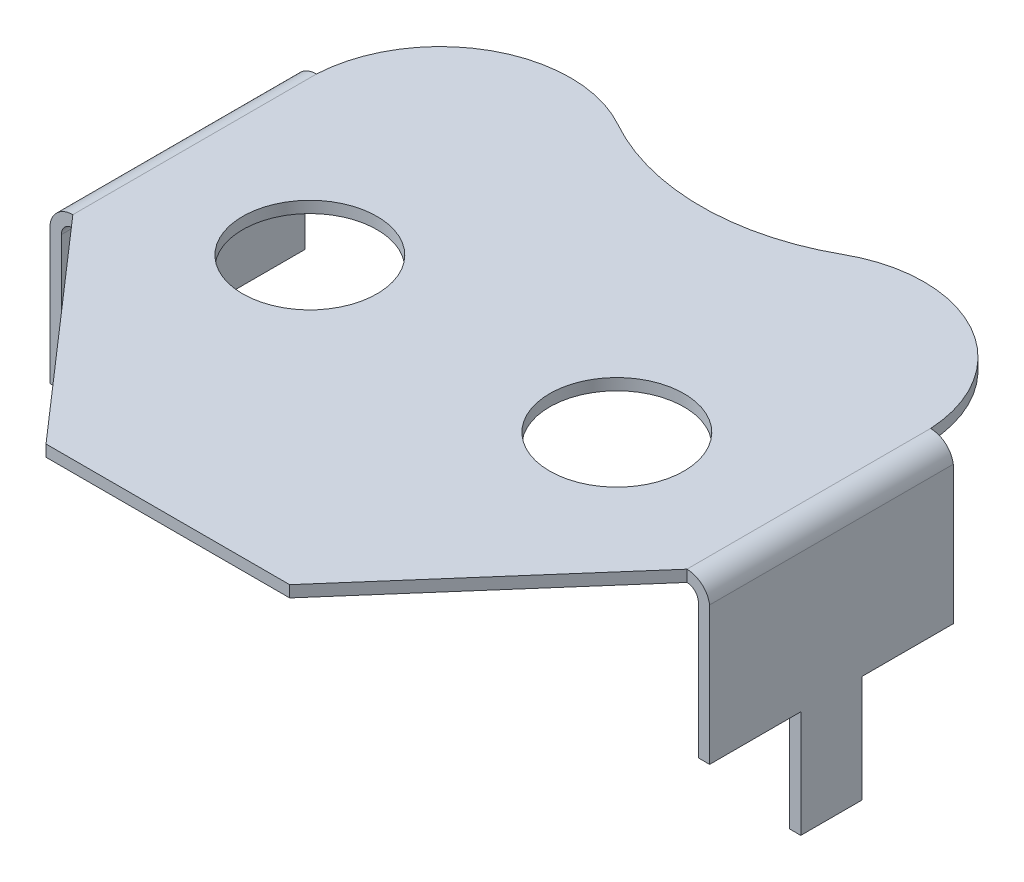
ISO-10303-21;
HEADER;
FILE_DESCRIPTION(('STEP AP214'),'2;1');
FILE_NAME('part.step','',(''),(''),'','','');
FILE_SCHEMA(('AUTOMOTIVE_DESIGN { 1 0 10303 214 1 1 1 1 }'));
ENDSEC;
DATA;
#1=APPLICATION_CONTEXT('core data for automotive mechanical design processes');
#2=APPLICATION_PROTOCOL_DEFINITION('international standard','automotive_design',2000,#1);
#3=PRODUCT_CONTEXT('',#1,'mechanical');
#4=PRODUCT('Part','Part','',(#3));
#5=PRODUCT_RELATED_PRODUCT_CATEGORY('part','',(#4));
#6=PRODUCT_DEFINITION_FORMATION('','',#4);
#7=PRODUCT_DEFINITION_CONTEXT('part definition',#1,'design');
#8=PRODUCT_DEFINITION('design','',#6,#7);
#9=PRODUCT_DEFINITION_SHAPE('','',#8);
#10=(LENGTH_UNIT() NAMED_UNIT(*) SI_UNIT(.MILLI.,.METRE.));
#11=(NAMED_UNIT(*) PLANE_ANGLE_UNIT() SI_UNIT($,.RADIAN.));
#12=(NAMED_UNIT(*) SI_UNIT($,.STERADIAN.) SOLID_ANGLE_UNIT());
#13=UNCERTAINTY_MEASURE_WITH_UNIT(LENGTH_MEASURE(1.E-05),#10,'distance_accuracy_value','');
#14=(GEOMETRIC_REPRESENTATION_CONTEXT(3) GLOBAL_UNCERTAINTY_ASSIGNED_CONTEXT((#13)) GLOBAL_UNIT_ASSIGNED_CONTEXT((#10,
#11,#12)) REPRESENTATION_CONTEXT('',''));
#15=CARTESIAN_POINT('',(0.,0.,0.));
#16=DIRECTION('',(0.,0.,1.));
#17=DIRECTION('',(1.,0.,0.));
#18=AXIS2_PLACEMENT_3D('',#15,#16,#17);
#19=CARTESIAN_POINT('',(-8.593211597999,-2.79,-3.175));
#20=DIRECTION('',(-1.,0.,0.));
#21=DIRECTION('',(0.,0.,1.));
#22=AXIS2_PLACEMENT_3D('',#19,#20,#21);
#23=PLANE('',#22);
#24=DIRECTION('',(0.,1.,0.));
#25=VECTOR('',#24,1.);
#26=CARTESIAN_POINT('',(-8.593211597999,3.6,3.175));
#27=LINE('',#26,#25);
#28=CARTESIAN_POINT('',(-8.593211597999,0.,3.175));
#29=VERTEX_POINT('',#28);
#30=CARTESIAN_POINT('',(-8.59321159799878,3.5999999999985,3.175));
#31=VERTEX_POINT('',#30);
#32=EDGE_CURVE('E231',#29,#31,#27,.T.);
#33=ORIENTED_EDGE('',*,*,#32,.T.);
#34=DIRECTION('',(0.,0.,-1.));
#35=VECTOR('',#34,1.);
#36=CARTESIAN_POINT('',(-8.59321159799857,3.59999999999993,10.));
#37=LINE('',#36,#35);
#38=CARTESIAN_POINT('',(-8.59321159799878,3.5999999999985,-3.175));
#39=VERTEX_POINT('',#38);
#40=EDGE_CURVE('E219',#39,#31,#37,.F.);
#41=ORIENTED_EDGE('',*,*,#40,.F.);
#42=DIRECTION('',(0.,-1.,0.));
#43=VECTOR('',#42,1.);
#44=CARTESIAN_POINT('',(-8.593211597999,0.,-3.175));
#45=LINE('',#44,#43);
#46=CARTESIAN_POINT('',(-8.593211597999,0.,-3.175));
#47=VERTEX_POINT('',#46);
#48=EDGE_CURVE('E185',#39,#47,#45,.T.);
#49=ORIENTED_EDGE('',*,*,#48,.T.);
#50=DIRECTION('',(0.,0.,1.));
#51=VECTOR('',#50,1.);
#52=CARTESIAN_POINT('',(-8.593211597999,0.,-0.8));
#53=LINE('',#52,#51);
#54=CARTESIAN_POINT('',(-8.593211597999,0.,-0.799999999999997));
#55=VERTEX_POINT('',#54);
#56=EDGE_CURVE('E184',#47,#55,#53,.T.);
#57=ORIENTED_EDGE('',*,*,#56,.T.);
#58=DIRECTION('',(0.,-1.,0.));
#59=VECTOR('',#58,1.);
#60=CARTESIAN_POINT('',(-8.593211597999,-2.79,-0.8));
#61=LINE('',#60,#59);
#62=CARTESIAN_POINT('',(-8.593211597999,-2.79,-0.8));
#63=VERTEX_POINT('',#62);
#64=EDGE_CURVE('E263',#55,#63,#61,.T.);
#65=ORIENTED_EDGE('',*,*,#64,.T.);
#66=DIRECTION('',(0.,0.,-1.));
#67=VECTOR('',#66,1.);
#68=CARTESIAN_POINT('',(-8.593211597999,-2.79,10.));
#69=LINE('',#68,#67);
#70=CARTESIAN_POINT('',(-8.593211597999,-2.79,0.800000000000003));
#71=VERTEX_POINT('',#70);
#72=EDGE_CURVE('E260',#71,#63,#69,.T.);
#73=ORIENTED_EDGE('',*,*,#72,.F.);
#74=DIRECTION('',(0.,1.,0.));
#75=VECTOR('',#74,1.);
#76=CARTESIAN_POINT('',(-8.593211597999,0.,0.8));
#77=LINE('',#76,#75);
#78=CARTESIAN_POINT('',(-8.593211597999,0.,0.8));
#79=VERTEX_POINT('',#78);
#80=EDGE_CURVE('E255',#71,#79,#77,.T.);
#81=ORIENTED_EDGE('',*,*,#80,.T.);
#82=DIRECTION('',(0.,0.,1.));
#83=VECTOR('',#82,1.);
#84=CARTESIAN_POINT('',(-8.593211597999,0.,3.175));
#85=LINE('',#84,#83);
#86=EDGE_CURVE('E249',#79,#29,#85,.T.);
#87=ORIENTED_EDGE('',*,*,#86,.T.);
#88=EDGE_LOOP('',(#33,#41,#49,#57,#65,#73,#81,#87));
#89=FACE_BOUND('',#88,.T.);
#90=ADVANCED_FACE('F17',(#89),#23,.T.);
#91=CARTESIAN_POINT('',(8.593211597999,-2.79,-3.175));
#92=DIRECTION('',(1.,0.,0.));
#93=DIRECTION('',(0.,0.,-1.));
#94=AXIS2_PLACEMENT_3D('',#91,#92,#93);
#95=PLANE('',#94);
#96=DIRECTION('',(0.,-1.,0.));
#97=VECTOR('',#96,1.);
#98=CARTESIAN_POINT('',(8.593211597999,0.,-3.175));
#99=LINE('',#98,#97);
#100=CARTESIAN_POINT('',(8.593211597999,0.,-3.175));
#101=VERTEX_POINT('',#100);
#102=CARTESIAN_POINT('',(8.59321159799878,3.5999999999985,-3.175));
#103=VERTEX_POINT('',#102);
#104=EDGE_CURVE('E315',#101,#103,#99,.F.);
#105=ORIENTED_EDGE('',*,*,#104,.T.);
#106=DIRECTION('',(0.,0.,-1.));
#107=VECTOR('',#106,1.);
#108=CARTESIAN_POINT('',(8.59321159799857,3.59999999999993,10.));
#109=LINE('',#108,#107);
#110=CARTESIAN_POINT('',(8.59321159799878,3.5999999999985,3.175));
#111=VERTEX_POINT('',#110);
#112=EDGE_CURVE('E216',#111,#103,#109,.T.);
#113=ORIENTED_EDGE('',*,*,#112,.F.);
#114=DIRECTION('',(0.,1.,0.));
#115=VECTOR('',#114,1.);
#116=CARTESIAN_POINT('',(8.593211597999,3.6,3.175));
#117=LINE('',#116,#115);
#118=CARTESIAN_POINT('',(8.593211597999,0.,3.175));
#119=VERTEX_POINT('',#118);
#120=EDGE_CURVE('E770',#111,#119,#117,.F.);
#121=ORIENTED_EDGE('',*,*,#120,.T.);
#122=DIRECTION('',(0.,0.,1.));
#123=VECTOR('',#122,1.);
#124=CARTESIAN_POINT('',(8.593211597999,0.,3.175));
#125=LINE('',#124,#123);
#126=CARTESIAN_POINT('',(8.593211597999,0.,0.8));
#127=VERTEX_POINT('',#126);
#128=EDGE_CURVE('E222',#119,#127,#125,.F.);
#129=ORIENTED_EDGE('',*,*,#128,.T.);
#130=DIRECTION('',(0.,1.,0.));
#131=VECTOR('',#130,1.);
#132=CARTESIAN_POINT('',(8.593211597999,0.,0.8));
#133=LINE('',#132,#131);
#134=CARTESIAN_POINT('',(8.593211597999,-2.79,0.800000000000002));
#135=VERTEX_POINT('',#134);
#136=EDGE_CURVE('E227',#127,#135,#133,.F.);
#137=ORIENTED_EDGE('',*,*,#136,.T.);
#138=DIRECTION('',(0.,0.,-1.));
#139=VECTOR('',#138,1.);
#140=CARTESIAN_POINT('',(8.593211597999,-2.79,10.));
#141=LINE('',#140,#139);
#142=CARTESIAN_POINT('',(8.593211597999,-2.79,-0.8));
#143=VERTEX_POINT('',#142);
#144=EDGE_CURVE('E230',#143,#135,#141,.F.);
#145=ORIENTED_EDGE('',*,*,#144,.F.);
#146=DIRECTION('',(0.,-1.,0.));
#147=VECTOR('',#146,1.);
#148=CARTESIAN_POINT('',(8.593211597999,-2.79,-0.8));
#149=LINE('',#148,#147);
#150=CARTESIAN_POINT('',(8.593211597999,0.,-0.799999999999998));
#151=VERTEX_POINT('',#150);
#152=EDGE_CURVE('E240',#143,#151,#149,.F.);
#153=ORIENTED_EDGE('',*,*,#152,.T.);
#154=DIRECTION('',(0.,0.,1.));
#155=VECTOR('',#154,1.);
#156=CARTESIAN_POINT('',(8.593211597999,0.,-0.8));
#157=LINE('',#156,#155);
#158=EDGE_CURVE('E234',#151,#101,#157,.F.);
#159=ORIENTED_EDGE('',*,*,#158,.T.);
#160=EDGE_LOOP('',(#105,#113,#121,#129,#137,#145,#153,#159));
#161=FACE_BOUND('',#160,.T.);
#162=ADVANCED_FACE('F697',(#161),#95,.T.);
#163=CARTESIAN_POINT('',(44.457849426068,0.,-3.175));
#164=DIRECTION('',(0.,0.,1.));
#165=DIRECTION('',(0.,-1.,0.));
#166=AXIS2_PLACEMENT_3D('',#163,#164,#165);
#167=PLANE('',#166);
#168=CARTESIAN_POINT('',(-8.,3.51,-3.175));
#169=DIRECTION('',(0.,0.,-1.));
#170=DIRECTION('',(-1.,0.,0.));
#171=AXIS2_PLACEMENT_3D('',#168,#169,#170);
#172=CIRCLE('',#171,0.6);
#173=CARTESIAN_POINT('',(-8.,4.11,-3.17499999999724));
#174=VERTEX_POINT('',#173);
#175=EDGE_CURVE('E221',#174,#39,#172,.F.);
#176=ORIENTED_EDGE('',*,*,#175,.F.);
#177=DIRECTION('',(0.,-1.,0.));
#178=VECTOR('',#177,1.);
#179=CARTESIAN_POINT('',(-8.,0.,-3.175));
#180=LINE('',#179,#178);
#181=CARTESIAN_POINT('',(-8.,3.81,-3.17499999999724));
#182=VERTEX_POINT('',#181);
#183=EDGE_CURVE('E212',#182,#174,#180,.F.);
#184=ORIENTED_EDGE('',*,*,#183,.F.);
#185=CARTESIAN_POINT('',(-8.,3.51,-3.175));
#186=DIRECTION('',(0.,0.,-1.));
#187=DIRECTION('',(-1.,0.,0.));
#188=AXIS2_PLACEMENT_3D('',#185,#186,#187);
#189=CIRCLE('',#188,0.3);
#190=CARTESIAN_POINT('',(-8.3,3.51,-3.175));
#191=VERTEX_POINT('',#190);
#192=EDGE_CURVE('E20',#191,#182,#189,.T.);
#193=ORIENTED_EDGE('',*,*,#192,.F.);
#194=DIRECTION('',(0.,1.,0.));
#195=VECTOR('',#194,1.);
#196=CARTESIAN_POINT('',(-8.3,-2.79,-3.175));
#197=LINE('',#196,#195);
#198=CARTESIAN_POINT('',(-8.3,0.,-3.175));
#199=VERTEX_POINT('',#198);
#200=EDGE_CURVE('E192',#191,#199,#197,.F.);
#201=ORIENTED_EDGE('',*,*,#200,.T.);
#202=DIRECTION('',(1.,0.,0.));
#203=VECTOR('',#202,1.);
#204=CARTESIAN_POINT('',(44.457849426068,0.,-3.175));
#205=LINE('',#204,#203);
#206=EDGE_CURVE('E179',#199,#47,#205,.F.);
#207=ORIENTED_EDGE('',*,*,#206,.T.);
#208=ORIENTED_EDGE('',*,*,#48,.F.);
#209=EDGE_LOOP('',(#176,#184,#193,#201,#207,#208));
#210=FACE_BOUND('',#209,.T.);
#211=ADVANCED_FACE('F199',(#210),#167,.F.);
#212=CARTESIAN_POINT('',(44.457849426068,0.,-0.8));
#213=DIRECTION('',(0.,1.,0.));
#214=DIRECTION('',(0.,0.,1.));
#215=AXIS2_PLACEMENT_3D('',#212,#213,#214);
#216=PLANE('',#215);
#217=ORIENTED_EDGE('',*,*,#206,.F.);
#218=DIRECTION('',(0.,0.,1.));
#219=VECTOR('',#218,1.);
#220=CARTESIAN_POINT('',(-8.3,0.,10.));
#221=LINE('',#220,#219);
#222=CARTESIAN_POINT('',(-8.3,0.,-0.799999999999999));
#223=VERTEX_POINT('',#222);
#224=EDGE_CURVE('E183',#199,#223,#221,.T.);
#225=ORIENTED_EDGE('',*,*,#224,.T.);
#226=DIRECTION('',(1.,0.,0.));
#227=VECTOR('',#226,1.);
#228=CARTESIAN_POINT('',(44.457849426068,0.,-0.799999999999995));
#229=LINE('',#228,#227);
#230=EDGE_CURVE('E268',#223,#55,#229,.F.);
#231=ORIENTED_EDGE('',*,*,#230,.T.);
#232=ORIENTED_EDGE('',*,*,#56,.F.);
#233=EDGE_LOOP('',(#217,#225,#231,#232));
#234=FACE_BOUND('',#233,.T.);
#235=ADVANCED_FACE('F181',(#234),#216,.F.);
#236=CARTESIAN_POINT('',(44.457849426068,-2.79,-0.8));
#237=DIRECTION('',(0.,0.,1.));
#238=DIRECTION('',(0.,-1.,0.));
#239=AXIS2_PLACEMENT_3D('',#236,#237,#238);
#240=PLANE('',#239);
#241=ORIENTED_EDGE('',*,*,#230,.F.);
#242=DIRECTION('',(0.,1.,0.));
#243=VECTOR('',#242,1.);
#244=CARTESIAN_POINT('',(-8.3,-2.79,-0.8));
#245=LINE('',#244,#243);
#246=CARTESIAN_POINT('',(-8.3,-2.79,-0.8));
#247=VERTEX_POINT('',#246);
#248=EDGE_CURVE('E196',#223,#247,#245,.F.);
#249=ORIENTED_EDGE('',*,*,#248,.T.);
#250=DIRECTION('',(1.,0.,0.));
#251=VECTOR('',#250,1.);
#252=CARTESIAN_POINT('',(-8.3,-2.79,-0.8));
#253=LINE('',#252,#251);
#254=EDGE_CURVE('E262',#63,#247,#253,.T.);
#255=ORIENTED_EDGE('',*,*,#254,.F.);
#256=ORIENTED_EDGE('',*,*,#64,.F.);
#257=EDGE_LOOP('',(#241,#249,#255,#256));
#258=FACE_BOUND('',#257,.T.);
#259=ADVANCED_FACE('F378',(#258),#240,.F.);
#260=CARTESIAN_POINT('',(-8.3,-2.79,10.));
#261=DIRECTION('',(0.,-1.,0.));
#262=DIRECTION('',(0.,0.,-1.));
#263=AXIS2_PLACEMENT_3D('',#260,#261,#262);
#264=PLANE('',#263);
#265=ORIENTED_EDGE('',*,*,#254,.T.);
#266=DIRECTION('',(0.,0.,1.));
#267=VECTOR('',#266,1.);
#268=CARTESIAN_POINT('',(-8.3,-2.79,10.));
#269=LINE('',#268,#267);
#270=CARTESIAN_POINT('',(-8.3,-2.79,0.800000000000002));
#271=VERTEX_POINT('',#270);
#272=EDGE_CURVE('E355',#247,#271,#269,.T.);
#273=ORIENTED_EDGE('',*,*,#272,.T.);
#274=DIRECTION('',(1.,0.,0.));
#275=VECTOR('',#274,1.);
#276=CARTESIAN_POINT('',(44.457849426068,-2.79,0.800000000000005));
#277=LINE('',#276,#275);
#278=EDGE_CURVE('E257',#271,#71,#277,.F.);
#279=ORIENTED_EDGE('',*,*,#278,.T.);
#280=ORIENTED_EDGE('',*,*,#72,.T.);
#281=EDGE_LOOP('',(#265,#273,#279,#280));
#282=FACE_BOUND('',#281,.T.);
#283=ADVANCED_FACE('F420',(#282),#264,.T.);
#284=CARTESIAN_POINT('',(44.457849426068,0.,0.8));
#285=DIRECTION('',(0.,0.,-1.));
#286=DIRECTION('',(0.,1.,0.));
#287=AXIS2_PLACEMENT_3D('',#284,#285,#286);
#288=PLANE('',#287);
#289=ORIENTED_EDGE('',*,*,#278,.F.);
#290=DIRECTION('',(0.,1.,0.));
#291=VECTOR('',#290,1.);
#292=CARTESIAN_POINT('',(-8.3,-2.79,0.8));
#293=LINE('',#292,#291);
#294=CARTESIAN_POINT('',(-8.3,0.,0.8));
#295=VERTEX_POINT('',#294);
#296=EDGE_CURVE('E346',#271,#295,#293,.T.);
#297=ORIENTED_EDGE('',*,*,#296,.T.);
#298=DIRECTION('',(1.,0.,0.));
#299=VECTOR('',#298,1.);
#300=CARTESIAN_POINT('',(44.457849426068,0.,0.8));
#301=LINE('',#300,#299);
#302=EDGE_CURVE('E252',#295,#79,#301,.F.);
#303=ORIENTED_EDGE('',*,*,#302,.T.);
#304=ORIENTED_EDGE('',*,*,#80,.F.);
#305=EDGE_LOOP('',(#289,#297,#303,#304));
#306=FACE_BOUND('',#305,.T.);
#307=ADVANCED_FACE('F418',(#306),#288,.F.);
#308=CARTESIAN_POINT('',(44.457849426068,0.,3.175));
#309=DIRECTION('',(0.,1.,0.));
#310=DIRECTION('',(0.,0.,1.));
#311=AXIS2_PLACEMENT_3D('',#308,#309,#310);
#312=PLANE('',#311);
#313=ORIENTED_EDGE('',*,*,#302,.F.);
#314=DIRECTION('',(0.,0.,1.));
#315=VECTOR('',#314,1.);
#316=CARTESIAN_POINT('',(-8.3,0.,10.));
#317=LINE('',#316,#315);
#318=CARTESIAN_POINT('',(-8.3,0.,3.175));
#319=VERTEX_POINT('',#318);
#320=EDGE_CURVE('E337',#295,#319,#317,.T.);
#321=ORIENTED_EDGE('',*,*,#320,.T.);
#322=DIRECTION('',(1.,0.,0.));
#323=VECTOR('',#322,1.);
#324=CARTESIAN_POINT('',(44.457849426068,0.,3.175));
#325=LINE('',#324,#323);
#326=EDGE_CURVE('E319',#319,#29,#325,.F.);
#327=ORIENTED_EDGE('',*,*,#326,.T.);
#328=ORIENTED_EDGE('',*,*,#86,.F.);
#329=EDGE_LOOP('',(#313,#321,#327,#328));
#330=FACE_BOUND('',#329,.T.);
#331=ADVANCED_FACE('F415',(#330),#312,.F.);
#332=CARTESIAN_POINT('',(44.457849426068,3.6,3.175));
#333=DIRECTION('',(0.,0.,-1.));
#334=DIRECTION('',(0.,1.,0.));
#335=AXIS2_PLACEMENT_3D('',#332,#333,#334);
#336=PLANE('',#335);
#337=ORIENTED_EDGE('',*,*,#326,.F.);
#338=DIRECTION('',(0.,1.,0.));
#339=VECTOR('',#338,1.);
#340=CARTESIAN_POINT('',(-8.3,-2.79,3.175));
#341=LINE('',#340,#339);
#342=CARTESIAN_POINT('',(-8.3,3.51,3.175));
#343=VERTEX_POINT('',#342);
#344=EDGE_CURVE('E334',#319,#343,#341,.T.);
#345=ORIENTED_EDGE('',*,*,#344,.T.);
#346=CARTESIAN_POINT('',(-8.,3.51,3.175));
#347=DIRECTION('',(0.,0.,-1.));
#348=DIRECTION('',(-1.,0.,0.));
#349=AXIS2_PLACEMENT_3D('',#346,#347,#348);
#350=CIRCLE('',#349,0.3);
#351=CARTESIAN_POINT('',(-8.,3.81,3.175));
#352=VERTEX_POINT('',#351);
#353=EDGE_CURVE('E318',#352,#343,#350,.F.);
#354=ORIENTED_EDGE('',*,*,#353,.F.);
#355=DIRECTION('',(0.,1.,0.));
#356=VECTOR('',#355,1.);
#357=CARTESIAN_POINT('',(-8.,3.6,3.175));
#358=LINE('',#357,#356);
#359=CARTESIAN_POINT('',(-8.,4.11,3.175));
#360=VERTEX_POINT('',#359);
#361=EDGE_CURVE('E251',#360,#352,#358,.F.);
#362=ORIENTED_EDGE('',*,*,#361,.F.);
#363=CARTESIAN_POINT('',(-8.,3.51,3.175));
#364=DIRECTION('',(0.,0.,-1.));
#365=DIRECTION('',(-1.,0.,0.));
#366=AXIS2_PLACEMENT_3D('',#363,#364,#365);
#367=CIRCLE('',#366,0.6);
#368=EDGE_CURVE('E218',#31,#360,#367,.T.);
#369=ORIENTED_EDGE('',*,*,#368,.F.);
#370=ORIENTED_EDGE('',*,*,#32,.F.);
#371=EDGE_LOOP('',(#337,#345,#354,#362,#369,#370));
#372=FACE_BOUND('',#371,.T.);
#373=ADVANCED_FACE('F509',(#372),#336,.F.);
#374=CARTESIAN_POINT('',(44.457849426068,0.,0.8));
#375=DIRECTION('',(0.,0.,-1.));
#376=DIRECTION('',(0.,1.,0.));
#377=AXIS2_PLACEMENT_3D('',#374,#375,#376);
#378=PLANE('',#377);
#379=DIRECTION('',(1.,0.,0.));
#380=VECTOR('',#379,1.);
#381=CARTESIAN_POINT('',(44.457849426068,0.,0.8));
#382=LINE('',#381,#380);
#383=CARTESIAN_POINT('',(8.3,0.,0.8));
#384=VERTEX_POINT('',#383);
#385=EDGE_CURVE('E772',#127,#384,#382,.F.);
#386=ORIENTED_EDGE('',*,*,#385,.T.);
#387=DIRECTION('',(0.,1.,0.));
#388=VECTOR('',#387,1.);
#389=CARTESIAN_POINT('',(8.3,3.51,0.8));
#390=LINE('',#389,#388);
#391=CARTESIAN_POINT('',(8.3,-2.79,0.8));
#392=VERTEX_POINT('',#391);
#393=EDGE_CURVE('E336',#384,#392,#390,.F.);
#394=ORIENTED_EDGE('',*,*,#393,.T.);
#395=DIRECTION('',(1.,0.,0.));
#396=VECTOR('',#395,1.);
#397=CARTESIAN_POINT('',(8.6,-2.79,0.8));
#398=LINE('',#397,#396);
#399=EDGE_CURVE('E246',#135,#392,#398,.F.);
#400=ORIENTED_EDGE('',*,*,#399,.F.);
#401=ORIENTED_EDGE('',*,*,#136,.F.);
#402=EDGE_LOOP('',(#386,#394,#400,#401));
#403=FACE_BOUND('',#402,.T.);
#404=ADVANCED_FACE('F505',(#403),#378,.F.);
#405=CARTESIAN_POINT('',(8.6,-2.79,10.));
#406=DIRECTION('',(0.,-1.,0.));
#407=DIRECTION('',(0.,0.,-1.));
#408=AXIS2_PLACEMENT_3D('',#405,#406,#407);
#409=PLANE('',#408);
#410=ORIENTED_EDGE('',*,*,#399,.T.);
#411=DIRECTION('',(0.,0.,-1.));
#412=VECTOR('',#411,1.);
#413=CARTESIAN_POINT('',(8.3,-2.79,10.));
#414=LINE('',#413,#412);
#415=CARTESIAN_POINT('',(8.3,-2.79,-0.8));
#416=VERTEX_POINT('',#415);
#417=EDGE_CURVE('E812',#392,#416,#414,.T.);
#418=ORIENTED_EDGE('',*,*,#417,.T.);
#419=DIRECTION('',(1.,0.,0.));
#420=VECTOR('',#419,1.);
#421=CARTESIAN_POINT('',(44.457849426068,-2.79,-0.8));
#422=LINE('',#421,#420);
#423=EDGE_CURVE('E242',#416,#143,#422,.T.);
#424=ORIENTED_EDGE('',*,*,#423,.T.);
#425=ORIENTED_EDGE('',*,*,#144,.T.);
#426=EDGE_LOOP('',(#410,#418,#424,#425));
#427=FACE_BOUND('',#426,.T.);
#428=ADVANCED_FACE('F501',(#427),#409,.T.);
#429=CARTESIAN_POINT('',(44.457849426068,-2.79,-0.8));
#430=DIRECTION('',(0.,0.,1.));
#431=DIRECTION('',(0.,-1.,0.));
#432=AXIS2_PLACEMENT_3D('',#429,#430,#431);
#433=PLANE('',#432);
#434=ORIENTED_EDGE('',*,*,#423,.F.);
#435=DIRECTION('',(0.,1.,0.));
#436=VECTOR('',#435,1.);
#437=CARTESIAN_POINT('',(8.3,3.51,-0.8));
#438=LINE('',#437,#436);
#439=CARTESIAN_POINT('',(8.3,0.,-0.8));
#440=VERTEX_POINT('',#439);
#441=EDGE_CURVE('E803',#416,#440,#438,.T.);
#442=ORIENTED_EDGE('',*,*,#441,.T.);
#443=DIRECTION('',(1.,0.,0.));
#444=VECTOR('',#443,1.);
#445=CARTESIAN_POINT('',(44.457849426068,0.,-0.8));
#446=LINE('',#445,#444);
#447=EDGE_CURVE('E237',#440,#151,#446,.T.);
#448=ORIENTED_EDGE('',*,*,#447,.T.);
#449=ORIENTED_EDGE('',*,*,#152,.F.);
#450=EDGE_LOOP('',(#434,#442,#448,#449));
#451=FACE_BOUND('',#450,.T.);
#452=ADVANCED_FACE('F497',(#451),#433,.F.);
#453=CARTESIAN_POINT('',(44.457849426068,0.,-0.8));
#454=DIRECTION('',(0.,1.,0.));
#455=DIRECTION('',(0.,0.,1.));
#456=AXIS2_PLACEMENT_3D('',#453,#454,#455);
#457=PLANE('',#456);
#458=ORIENTED_EDGE('',*,*,#447,.F.);
#459=DIRECTION('',(0.,0.,-1.));
#460=VECTOR('',#459,1.);
#461=CARTESIAN_POINT('',(8.3,0.,10.));
#462=LINE('',#461,#460);
#463=CARTESIAN_POINT('',(8.3,0.,-3.175));
#464=VERTEX_POINT('',#463);
#465=EDGE_CURVE('E795',#440,#464,#462,.T.);
#466=ORIENTED_EDGE('',*,*,#465,.T.);
#467=DIRECTION('',(1.,0.,0.));
#468=VECTOR('',#467,1.);
#469=CARTESIAN_POINT('',(44.457849426068,0.,-3.175));
#470=LINE('',#469,#468);
#471=EDGE_CURVE('E317',#464,#101,#470,.T.);
#472=ORIENTED_EDGE('',*,*,#471,.T.);
#473=ORIENTED_EDGE('',*,*,#158,.F.);
#474=EDGE_LOOP('',(#458,#466,#472,#473));
#475=FACE_BOUND('',#474,.T.);
#476=ADVANCED_FACE('F493',(#475),#457,.F.);
#477=CARTESIAN_POINT('',(44.457849426068,0.,-3.175));
#478=DIRECTION('',(0.,0.,1.));
#479=DIRECTION('',(0.,-1.,0.));
#480=AXIS2_PLACEMENT_3D('',#477,#478,#479);
#481=PLANE('',#480);
#482=ORIENTED_EDGE('',*,*,#471,.F.);
#483=DIRECTION('',(0.,1.,0.));
#484=VECTOR('',#483,1.);
#485=CARTESIAN_POINT('',(8.3,3.51,-3.175));
#486=LINE('',#485,#484);
#487=CARTESIAN_POINT('',(8.3,3.51,-3.175));
#488=VERTEX_POINT('',#487);
#489=EDGE_CURVE('E781',#464,#488,#486,.T.);
#490=ORIENTED_EDGE('',*,*,#489,.T.);
#491=CARTESIAN_POINT('',(8.,3.51,-3.175));
#492=DIRECTION('',(0.,0.,-1.));
#493=DIRECTION('',(-1.,0.,0.));
#494=AXIS2_PLACEMENT_3D('',#491,#492,#493);
#495=CIRCLE('',#494,0.3);
#496=CARTESIAN_POINT('',(8.,3.81,-3.17499999999724));
#497=VERTEX_POINT('',#496);
#498=EDGE_CURVE('E316',#497,#488,#495,.T.);
#499=ORIENTED_EDGE('',*,*,#498,.F.);
#500=DIRECTION('',(0.,-1.,0.));
#501=VECTOR('',#500,1.);
#502=CARTESIAN_POINT('',(8.,0.,-3.175));
#503=LINE('',#502,#501);
#504=CARTESIAN_POINT('',(8.,4.11,-3.17499999999724));
#505=VERTEX_POINT('',#504);
#506=EDGE_CURVE('E236',#505,#497,#503,.T.);
#507=ORIENTED_EDGE('',*,*,#506,.F.);
#508=CARTESIAN_POINT('',(8.,3.51,-3.175));
#509=DIRECTION('',(0.,0.,-1.));
#510=DIRECTION('',(-1.,0.,0.));
#511=AXIS2_PLACEMENT_3D('',#508,#509,#510);
#512=CIRCLE('',#511,0.6);
#513=EDGE_CURVE('E203',#103,#505,#512,.F.);
#514=ORIENTED_EDGE('',*,*,#513,.F.);
#515=ORIENTED_EDGE('',*,*,#104,.F.);
#516=EDGE_LOOP('',(#482,#490,#499,#507,#514,#515));
#517=FACE_BOUND('',#516,.T.);
#518=ADVANCED_FACE('F489',(#517),#481,.F.);
#519=CARTESIAN_POINT('',(44.457849426068,3.6,3.175));
#520=DIRECTION('',(0.,0.,-1.));
#521=DIRECTION('',(0.,1.,0.));
#522=AXIS2_PLACEMENT_3D('',#519,#520,#521);
#523=PLANE('',#522);
#524=CARTESIAN_POINT('',(8.,3.51,3.175));
#525=DIRECTION('',(0.,0.,-1.));
#526=DIRECTION('',(-1.,0.,0.));
#527=AXIS2_PLACEMENT_3D('',#524,#525,#526);
#528=CIRCLE('',#527,0.6);
#529=CARTESIAN_POINT('',(8.,4.11,3.175));
#530=VERTEX_POINT('',#529);
#531=EDGE_CURVE('E200',#530,#111,#528,.T.);
#532=ORIENTED_EDGE('',*,*,#531,.F.);
#533=DIRECTION('',(0.,1.,0.));
#534=VECTOR('',#533,1.);
#535=CARTESIAN_POINT('',(8.,3.6,3.175));
#536=LINE('',#535,#534);
#537=CARTESIAN_POINT('',(8.,3.81,3.175));
#538=VERTEX_POINT('',#537);
#539=EDGE_CURVE('E314',#538,#530,#536,.T.);
#540=ORIENTED_EDGE('',*,*,#539,.F.);
#541=CARTESIAN_POINT('',(8.,3.51,3.175));
#542=DIRECTION('',(0.,0.,-1.));
#543=DIRECTION('',(-1.,0.,0.));
#544=AXIS2_PLACEMENT_3D('',#541,#542,#543);
#545=CIRCLE('',#544,0.3);
#546=CARTESIAN_POINT('',(8.3,3.51,3.175));
#547=VERTEX_POINT('',#546);
#548=EDGE_CURVE('E311',#547,#538,#545,.F.);
#549=ORIENTED_EDGE('',*,*,#548,.F.);
#550=DIRECTION('',(0.,1.,0.));
#551=VECTOR('',#550,1.);
#552=CARTESIAN_POINT('',(8.3,3.51,3.175));
#553=LINE('',#552,#551);
#554=CARTESIAN_POINT('',(8.3,0.,3.175));
#555=VERTEX_POINT('',#554);
#556=EDGE_CURVE('E778',#547,#555,#553,.F.);
#557=ORIENTED_EDGE('',*,*,#556,.T.);
#558=DIRECTION('',(1.,0.,0.));
#559=VECTOR('',#558,1.);
#560=CARTESIAN_POINT('',(44.457849426068,0.,3.175));
#561=LINE('',#560,#559);
#562=EDGE_CURVE('E114',#555,#119,#561,.T.);
#563=ORIENTED_EDGE('',*,*,#562,.T.);
#564=ORIENTED_EDGE('',*,*,#120,.F.);
#565=EDGE_LOOP('',(#532,#540,#549,#557,#563,#564));
#566=FACE_BOUND('',#565,.T.);
#567=ADVANCED_FACE('F486',(#566),#523,.F.);
#568=CARTESIAN_POINT('',(44.457849426068,0.,3.175));
#569=DIRECTION('',(0.,1.,0.));
#570=DIRECTION('',(0.,0.,1.));
#571=AXIS2_PLACEMENT_3D('',#568,#569,#570);
#572=PLANE('',#571);
#573=ORIENTED_EDGE('',*,*,#562,.F.);
#574=DIRECTION('',(0.,0.,-1.));
#575=VECTOR('',#574,1.);
#576=CARTESIAN_POINT('',(8.3,0.,10.));
#577=LINE('',#576,#575);
#578=EDGE_CURVE('E393',#555,#384,#577,.T.);
#579=ORIENTED_EDGE('',*,*,#578,.T.);
#580=ORIENTED_EDGE('',*,*,#385,.F.);
#581=ORIENTED_EDGE('',*,*,#128,.F.);
#582=EDGE_LOOP('',(#573,#579,#580,#581));
#583=FACE_BOUND('',#582,.T.);
#584=ADVANCED_FACE('F483',(#583),#572,.F.);
#585=CARTESIAN_POINT('',(-8.,3.51,10.));
#586=DIRECTION('',(0.,0.,-1.));
#587=DIRECTION('',(-1.,0.,0.));
#588=AXIS2_PLACEMENT_3D('',#585,#586,#587);
#589=CYLINDRICAL_SURFACE('',#588,0.6);
#590=ORIENTED_EDGE('',*,*,#40,.T.);
#591=ORIENTED_EDGE('',*,*,#368,.T.);
#592=DIRECTION('',(0.,0.,1.));
#593=VECTOR('',#592,1.);
#594=CARTESIAN_POINT('',(-8.,4.11,10.));
#595=LINE('',#594,#593);
#596=EDGE_CURVE('E388',#174,#360,#595,.T.);
#597=ORIENTED_EDGE('',*,*,#596,.F.);
#598=ORIENTED_EDGE('',*,*,#175,.T.);
#599=EDGE_LOOP('',(#590,#591,#597,#598));
#600=FACE_BOUND('',#599,.T.);
#601=ADVANCED_FACE('F386',(#600),#589,.T.);
#602=CARTESIAN_POINT('',(8.,3.51,10.));
#603=DIRECTION('',(0.,0.,-1.));
#604=DIRECTION('',(-1.,0.,0.));
#605=AXIS2_PLACEMENT_3D('',#602,#603,#604);
#606=CYLINDRICAL_SURFACE('',#605,0.6);
#607=DIRECTION('',(0.,0.,1.));
#608=VECTOR('',#607,1.);
#609=CARTESIAN_POINT('',(8.,4.11,10.));
#610=LINE('',#609,#608);
#611=EDGE_CURVE('E303',#530,#505,#610,.F.);
#612=ORIENTED_EDGE('',*,*,#611,.F.);
#613=ORIENTED_EDGE('',*,*,#531,.T.);
#614=ORIENTED_EDGE('',*,*,#112,.T.);
#615=ORIENTED_EDGE('',*,*,#513,.T.);
#616=EDGE_LOOP('',(#612,#613,#614,#615));
#617=FACE_BOUND('',#616,.T.);
#618=ADVANCED_FACE('F477',(#617),#606,.T.);
#619=CARTESIAN_POINT('',(-8.3,-2.79,10.));
#620=DIRECTION('',(-1.,0.,0.));
#621=DIRECTION('',(0.,0.,1.));
#622=AXIS2_PLACEMENT_3D('',#619,#620,#621);
#623=PLANE('',#622);
#624=ORIENTED_EDGE('',*,*,#344,.F.);
#625=ORIENTED_EDGE('',*,*,#320,.F.);
#626=ORIENTED_EDGE('',*,*,#296,.F.);
#627=ORIENTED_EDGE('',*,*,#272,.F.);
#628=ORIENTED_EDGE('',*,*,#248,.F.);
#629=ORIENTED_EDGE('',*,*,#224,.F.);
#630=ORIENTED_EDGE('',*,*,#200,.F.);
#631=DIRECTION('',(0.,0.,-1.));
#632=VECTOR('',#631,1.);
#633=CARTESIAN_POINT('',(-8.3,3.51,10.));
#634=LINE('',#633,#632);
#635=EDGE_CURVE('E300',#191,#343,#634,.F.);
#636=ORIENTED_EDGE('',*,*,#635,.T.);
#637=EDGE_LOOP('',(#624,#625,#626,#627,#628,#629,#630,#636));
#638=FACE_BOUND('',#637,.T.);
#639=ADVANCED_FACE('F190',(#638),#623,.F.);
#640=CARTESIAN_POINT('',(8.3,3.51,10.));
#641=DIRECTION('',(1.,0.,0.));
#642=DIRECTION('',(0.,0.,-1.));
#643=AXIS2_PLACEMENT_3D('',#640,#641,#642);
#644=PLANE('',#643);
#645=ORIENTED_EDGE('',*,*,#556,.F.);
#646=DIRECTION('',(0.,0.,-1.));
#647=VECTOR('',#646,1.);
#648=CARTESIAN_POINT('',(8.3,3.51,10.));
#649=LINE('',#648,#647);
#650=EDGE_CURVE('E296',#547,#488,#649,.T.);
#651=ORIENTED_EDGE('',*,*,#650,.T.);
#652=ORIENTED_EDGE('',*,*,#489,.F.);
#653=ORIENTED_EDGE('',*,*,#465,.F.);
#654=ORIENTED_EDGE('',*,*,#441,.F.);
#655=ORIENTED_EDGE('',*,*,#417,.F.);
#656=ORIENTED_EDGE('',*,*,#393,.F.);
#657=ORIENTED_EDGE('',*,*,#578,.F.);
#658=EDGE_LOOP('',(#645,#651,#652,#653,#654,#655,#656,#657));
#659=FACE_BOUND('',#658,.T.);
#660=ADVANCED_FACE('F471',(#659),#644,.F.);
#661=CARTESIAN_POINT('',(-8.,4.11,10.));
#662=DIRECTION('',(0.,1.,0.));
#663=DIRECTION('',(0.,0.,1.));
#664=AXIS2_PLACEMENT_3D('',#661,#662,#663);
#665=PLANE('',#664);
#666=ORIENTED_EDGE('',*,*,#611,.T.);
#667=CARTESIAN_POINT('',(4.604506663237,4.11,-3.));
#668=DIRECTION('',(0.,1.,0.));
#669=DIRECTION('',(0.,0.,1.));
#670=AXIS2_PLACEMENT_3D('',#667,#668,#669);
#671=CIRCLE('',#670,3.4);
#672=CARTESIAN_POINT('',(2.93904680632259,4.11,-5.96415982446732));
#673=VERTEX_POINT('',#672);
#674=EDGE_CURVE('E293',#673,#505,#671,.F.);
#675=ORIENTED_EDGE('',*,*,#674,.F.);
#676=CARTESIAN_POINT('',(0.,4.11,-11.19503010294));
#677=DIRECTION('',(0.,1.,0.));
#678=DIRECTION('',(0.,0.,1.));
#679=AXIS2_PLACEMENT_3D('',#676,#677,#678);
#680=CIRCLE('',#679,6.);
#681=CARTESIAN_POINT('',(-2.93904680632112,4.11,-5.96415982446995));
#682=VERTEX_POINT('',#681);
#683=EDGE_CURVE('E289',#673,#682,#680,.F.);
#684=ORIENTED_EDGE('',*,*,#683,.T.);
#685=CARTESIAN_POINT('',(-4.604506663237,4.11,-3.));
#686=DIRECTION('',(0.,1.,0.));
#687=DIRECTION('',(0.,0.,1.));
#688=AXIS2_PLACEMENT_3D('',#685,#686,#687);
#689=CIRCLE('',#688,3.4);
#690=EDGE_CURVE('E287',#174,#682,#689,.F.);
#691=ORIENTED_EDGE('',*,*,#690,.F.);
#692=ORIENTED_EDGE('',*,*,#596,.T.);
#693=DIRECTION('',(0.65778044015136,0.,0.753209726805412));
#694=VECTOR('',#693,1.);
#695=CARTESIAN_POINT('',(-8.,4.11,3.175));
#696=LINE('',#695,#694);
#697=CARTESIAN_POINT('',(-3.17499999999996,4.11,8.69999999999997));
#698=VERTEX_POINT('',#697);
#699=EDGE_CURVE('E340',#698,#360,#696,.F.);
#700=ORIENTED_EDGE('',*,*,#699,.F.);
#701=DIRECTION('',(1.,0.,0.));
#702=VECTOR('',#701,1.);
#703=CARTESIAN_POINT('',(-3.175,4.11,8.7));
#704=LINE('',#703,#702);
#705=CARTESIAN_POINT('',(3.17499999999989,4.11,8.69999999999994));
#706=VERTEX_POINT('',#705);
#707=EDGE_CURVE('E754',#706,#698,#704,.F.);
#708=ORIENTED_EDGE('',*,*,#707,.F.);
#709=DIRECTION('',(0.65778044015136,0.,-0.753209726805412));
#710=VECTOR('',#709,1.);
#711=CARTESIAN_POINT('',(8.,4.11,3.175));
#712=LINE('',#711,#710);
#713=EDGE_CURVE('E730',#530,#706,#712,.F.);
#714=ORIENTED_EDGE('',*,*,#713,.F.);
#715=EDGE_LOOP('',(#666,#675,#684,#691,#692,#700,#708,#714));
#716=FACE_BOUND('',#715,.T.);
#717=CARTESIAN_POINT('',(-4.,4.11,1.));
#718=DIRECTION('',(0.,1.,0.));
#719=DIRECTION('',(0.,0.,1.));
#720=AXIS2_PLACEMENT_3D('',#717,#718,#719);
#721=CIRCLE('',#720,1.75);
#722=CARTESIAN_POINT('',(-4.,4.11,2.75));
#723=VERTEX_POINT('',#722);
#724=EDGE_CURVE('E297',#723,#723,#721,.F.);
#725=ORIENTED_EDGE('',*,*,#724,.T.);
#726=EDGE_LOOP('',(#725));
#727=FACE_BOUND('',#726,.T.);
#728=CARTESIAN_POINT('',(4.,4.11,1.));
#729=DIRECTION('',(0.,1.,0.));
#730=DIRECTION('',(0.,0.,1.));
#731=AXIS2_PLACEMENT_3D('',#728,#729,#730);
#732=CIRCLE('',#731,1.75);
#733=CARTESIAN_POINT('',(4.,4.11,2.75));
#734=VERTEX_POINT('',#733);
#735=EDGE_CURVE('E301',#734,#734,#732,.F.);
#736=ORIENTED_EDGE('',*,*,#735,.T.);
#737=EDGE_LOOP('',(#736));
#738=FACE_BOUND('',#737,.T.);
#739=ADVANCED_FACE('F396',(#716,#727,#738),#665,.T.);
#740=CARTESIAN_POINT('',(4.,-2.79,1.));
#741=DIRECTION('',(0.,1.,0.));
#742=DIRECTION('',(0.,0.,1.));
#743=AXIS2_PLACEMENT_3D('',#740,#741,#742);
#744=CYLINDRICAL_SURFACE('',#743,1.75);
#745=CARTESIAN_POINT('',(4.,3.81,1.));
#746=DIRECTION('',(0.,1.,0.));
#747=DIRECTION('',(0.,0.,1.));
#748=AXIS2_PLACEMENT_3D('',#745,#746,#747);
#749=CIRCLE('',#748,1.75);
#750=CARTESIAN_POINT('',(4.,3.81,2.75));
#751=VERTEX_POINT('',#750);
#752=EDGE_CURVE('E283',#751,#751,#749,.F.);
#753=ORIENTED_EDGE('',*,*,#752,.T.);
#754=EDGE_LOOP('',(#753));
#755=FACE_BOUND('',#754,.T.);
#756=ORIENTED_EDGE('',*,*,#735,.F.);
#757=EDGE_LOOP('',(#756));
#758=FACE_BOUND('',#757,.T.);
#759=ADVANCED_FACE('F464',(#755,#758),#744,.F.);
#760=CARTESIAN_POINT('',(-4.,-2.79,1.));
#761=DIRECTION('',(0.,1.,0.));
#762=DIRECTION('',(0.,0.,1.));
#763=AXIS2_PLACEMENT_3D('',#760,#761,#762);
#764=CYLINDRICAL_SURFACE('',#763,1.75);
#765=CARTESIAN_POINT('',(-4.,3.81,1.));
#766=DIRECTION('',(0.,1.,0.));
#767=DIRECTION('',(0.,0.,1.));
#768=AXIS2_PLACEMENT_3D('',#765,#766,#767);
#769=CIRCLE('',#768,1.75);
#770=CARTESIAN_POINT('',(-4.,3.81,2.75));
#771=VERTEX_POINT('',#770);
#772=EDGE_CURVE('E279',#771,#771,#769,.F.);
#773=ORIENTED_EDGE('',*,*,#772,.T.);
#774=EDGE_LOOP('',(#773));
#775=FACE_BOUND('',#774,.T.);
#776=ORIENTED_EDGE('',*,*,#724,.F.);
#777=EDGE_LOOP('',(#776));
#778=FACE_BOUND('',#777,.T.);
#779=ADVANCED_FACE('F461',(#775,#778),#764,.F.);
#780=CARTESIAN_POINT('',(-8.,3.51,10.));
#781=DIRECTION('',(0.,0.,-1.));
#782=DIRECTION('',(-1.,0.,0.));
#783=AXIS2_PLACEMENT_3D('',#780,#781,#782);
#784=CYLINDRICAL_SURFACE('',#783,0.3);
#785=DIRECTION('',(0.,0.,1.));
#786=VECTOR('',#785,1.);
#787=CARTESIAN_POINT('',(-8.,3.81,10.));
#788=LINE('',#787,#786);
#789=EDGE_CURVE('E282',#182,#352,#788,.T.);
#790=ORIENTED_EDGE('',*,*,#789,.T.);
#791=ORIENTED_EDGE('',*,*,#353,.T.);
#792=ORIENTED_EDGE('',*,*,#635,.F.);
#793=ORIENTED_EDGE('',*,*,#192,.T.);
#794=EDGE_LOOP('',(#790,#791,#792,#793));
#795=FACE_BOUND('',#794,.T.);
#796=ADVANCED_FACE('F410',(#795),#784,.F.);
#797=CARTESIAN_POINT('',(-8.,-2.79,3.175));
#798=DIRECTION('',(-0.753209726805412,0.,0.65778044015136));
#799=DIRECTION('',(0.65778044015136,0.,0.753209726805412));
#800=AXIS2_PLACEMENT_3D('',#797,#798,#799);
#801=PLANE('',#800);
#802=ORIENTED_EDGE('',*,*,#699,.T.);
#803=ORIENTED_EDGE('',*,*,#361,.T.);
#804=DIRECTION('',(0.657780440151345,0.,0.753209726805425));
#805=VECTOR('',#804,1.);
#806=CARTESIAN_POINT('',(-8.,3.81,3.175));
#807=LINE('',#806,#805);
#808=CARTESIAN_POINT('',(-3.175,3.81,8.7));
#809=VERTEX_POINT('',#808);
#810=EDGE_CURVE('E408',#352,#809,#807,.T.);
#811=ORIENTED_EDGE('',*,*,#810,.T.);
#812=DIRECTION('',(0.,1.,0.));
#813=VECTOR('',#812,1.);
#814=CARTESIAN_POINT('',(-3.175,-2.79,8.7));
#815=LINE('',#814,#813);
#816=EDGE_CURVE('E751',#698,#809,#815,.F.);
#817=ORIENTED_EDGE('',*,*,#816,.F.);
#818=EDGE_LOOP('',(#802,#803,#811,#817));
#819=FACE_BOUND('',#818,.T.);
#820=ADVANCED_FACE('F455',(#819),#801,.T.);
#821=CARTESIAN_POINT('',(-3.175,-2.79,8.7));
#822=DIRECTION('',(0.,0.,1.));
#823=DIRECTION('',(1.,0.,0.));
#824=AXIS2_PLACEMENT_3D('',#821,#822,#823);
#825=PLANE('',#824);
#826=ORIENTED_EDGE('',*,*,#707,.T.);
#827=ORIENTED_EDGE('',*,*,#816,.T.);
#828=DIRECTION('',(1.,0.,0.));
#829=VECTOR('',#828,1.);
#830=CARTESIAN_POINT('',(-8.,3.81,8.7));
#831=LINE('',#830,#829);
#832=CARTESIAN_POINT('',(3.17499999999996,3.81,8.69999999999997));
#833=VERTEX_POINT('',#832);
#834=EDGE_CURVE('E739',#809,#833,#831,.T.);
#835=ORIENTED_EDGE('',*,*,#834,.T.);
#836=DIRECTION('',(0.,1.,0.));
#837=VECTOR('',#836,1.);
#838=CARTESIAN_POINT('',(3.17499999999989,-2.79,8.6999999999999));
#839=LINE('',#838,#837);
#840=EDGE_CURVE('E742',#706,#833,#839,.F.);
#841=ORIENTED_EDGE('',*,*,#840,.F.);
#842=EDGE_LOOP('',(#826,#827,#835,#841));
#843=FACE_BOUND('',#842,.T.);
#844=ADVANCED_FACE('F451',(#843),#825,.T.);
#845=CARTESIAN_POINT('',(8.,-2.79,3.175));
#846=DIRECTION('',(0.753209726805412,0.,0.65778044015136));
#847=DIRECTION('',(0.65778044015136,0.,-0.753209726805412));
#848=AXIS2_PLACEMENT_3D('',#845,#846,#847);
#849=PLANE('',#848);
#850=ORIENTED_EDGE('',*,*,#713,.T.);
#851=ORIENTED_EDGE('',*,*,#840,.T.);
#852=DIRECTION('',(0.657780440151345,0.,-0.753209726805426));
#853=VECTOR('',#852,1.);
#854=CARTESIAN_POINT('',(3.175,3.81,8.7));
#855=LINE('',#854,#853);
#856=EDGE_CURVE('E736',#833,#538,#855,.T.);
#857=ORIENTED_EDGE('',*,*,#856,.T.);
#858=ORIENTED_EDGE('',*,*,#539,.T.);
#859=EDGE_LOOP('',(#850,#851,#857,#858));
#860=FACE_BOUND('',#859,.T.);
#861=ADVANCED_FACE('F447',(#860),#849,.T.);
#862=CARTESIAN_POINT('',(8.,3.51,10.));
#863=DIRECTION('',(0.,0.,-1.));
#864=DIRECTION('',(-1.,0.,0.));
#865=AXIS2_PLACEMENT_3D('',#862,#863,#864);
#866=CYLINDRICAL_SURFACE('',#865,0.3);
#867=ORIENTED_EDGE('',*,*,#498,.T.);
#868=ORIENTED_EDGE('',*,*,#650,.F.);
#869=ORIENTED_EDGE('',*,*,#548,.T.);
#870=DIRECTION('',(0.,0.,1.));
#871=VECTOR('',#870,1.);
#872=CARTESIAN_POINT('',(8.,3.81,10.));
#873=LINE('',#872,#871);
#874=EDGE_CURVE('E278',#538,#497,#873,.F.);
#875=ORIENTED_EDGE('',*,*,#874,.T.);
#876=EDGE_LOOP('',(#867,#868,#869,#875));
#877=FACE_BOUND('',#876,.T.);
#878=ADVANCED_FACE('F443',(#877),#866,.F.);
#879=CARTESIAN_POINT('',(4.604506663237,-2.79,-3.));
#880=DIRECTION('',(0.,1.,0.));
#881=DIRECTION('',(0.,0.,1.));
#882=AXIS2_PLACEMENT_3D('',#879,#880,#881);
#883=CYLINDRICAL_SURFACE('',#882,3.4);
#884=ORIENTED_EDGE('',*,*,#674,.T.);
#885=ORIENTED_EDGE('',*,*,#506,.T.);
#886=CARTESIAN_POINT('',(4.604506663237,3.81,-3.));
#887=DIRECTION('',(0.,1.,0.));
#888=DIRECTION('',(0.,0.,1.));
#889=AXIS2_PLACEMENT_3D('',#886,#887,#888);
#890=CIRCLE('',#889,3.4);
#891=CARTESIAN_POINT('',(2.93904680632407,3.81,-5.9641598244647));
#892=VERTEX_POINT('',#891);
#893=EDGE_CURVE('E275',#497,#892,#890,.T.);
#894=ORIENTED_EDGE('',*,*,#893,.T.);
#895=DIRECTION('',(0.,1.,0.));
#896=VECTOR('',#895,1.);
#897=CARTESIAN_POINT('',(2.93904680632476,-2.79,-5.96415982446509));
#898=LINE('',#897,#896);
#899=EDGE_CURVE('E292',#892,#673,#898,.T.);
#900=ORIENTED_EDGE('',*,*,#899,.T.);
#901=EDGE_LOOP('',(#884,#885,#894,#900));
#902=FACE_BOUND('',#901,.T.);
#903=ADVANCED_FACE('F440',(#902),#883,.T.);
#904=CARTESIAN_POINT('',(0.,-2.79,-11.19503010294));
#905=DIRECTION('',(0.,1.,0.));
#906=DIRECTION('',(0.,0.,1.));
#907=AXIS2_PLACEMENT_3D('',#904,#905,#906);
#908=CYLINDRICAL_SURFACE('',#907,6.);
#909=CARTESIAN_POINT('',(0.,3.81,-11.19503010294));
#910=DIRECTION('',(0.,1.,0.));
#911=DIRECTION('',(0.,0.,1.));
#912=AXIS2_PLACEMENT_3D('',#909,#910,#911);
#913=CIRCLE('',#912,6.);
#914=CARTESIAN_POINT('',(-2.93904680632112,3.81,-5.96415982446995));
#915=VERTEX_POINT('',#914);
#916=EDGE_CURVE('E26',#892,#915,#913,.F.);
#917=ORIENTED_EDGE('',*,*,#916,.T.);
#918=DIRECTION('',(0.,1.,0.));
#919=VECTOR('',#918,1.);
#920=CARTESIAN_POINT('',(-2.93904680632181,-2.79,-5.96415982447034));
#921=LINE('',#920,#919);
#922=EDGE_CURVE('E286',#682,#915,#921,.F.);
#923=ORIENTED_EDGE('',*,*,#922,.F.);
#924=ORIENTED_EDGE('',*,*,#683,.F.);
#925=ORIENTED_EDGE('',*,*,#899,.F.);
#926=EDGE_LOOP('',(#917,#923,#924,#925));
#927=FACE_BOUND('',#926,.T.);
#928=ADVANCED_FACE('F435',(#927),#908,.F.);
#929=CARTESIAN_POINT('',(-4.604506663237,-2.79,-3.));
#930=DIRECTION('',(0.,1.,0.));
#931=DIRECTION('',(0.,0.,1.));
#932=AXIS2_PLACEMENT_3D('',#929,#930,#931);
#933=CYLINDRICAL_SURFACE('',#932,3.4);
#934=ORIENTED_EDGE('',*,*,#690,.T.);
#935=ORIENTED_EDGE('',*,*,#922,.T.);
#936=CARTESIAN_POINT('',(-4.604506663237,3.81,-3.));
#937=DIRECTION('',(0.,1.,0.));
#938=DIRECTION('',(0.,0.,1.));
#939=AXIS2_PLACEMENT_3D('',#936,#937,#938);
#940=CIRCLE('',#939,3.4);
#941=EDGE_CURVE('E11',#915,#182,#940,.T.);
#942=ORIENTED_EDGE('',*,*,#941,.T.);
#943=ORIENTED_EDGE('',*,*,#183,.T.);
#944=EDGE_LOOP('',(#934,#935,#942,#943));
#945=FACE_BOUND('',#944,.T.);
#946=ADVANCED_FACE('F400',(#945),#933,.T.);
#947=CARTESIAN_POINT('',(-8.,3.81,10.));
#948=DIRECTION('',(0.,1.,0.));
#949=DIRECTION('',(0.,0.,1.));
#950=AXIS2_PLACEMENT_3D('',#947,#948,#949);
#951=PLANE('',#950);
#952=ORIENTED_EDGE('',*,*,#941,.F.);
#953=ORIENTED_EDGE('',*,*,#916,.F.);
#954=ORIENTED_EDGE('',*,*,#893,.F.);
#955=ORIENTED_EDGE('',*,*,#874,.F.);
#956=ORIENTED_EDGE('',*,*,#856,.F.);
#957=ORIENTED_EDGE('',*,*,#834,.F.);
#958=ORIENTED_EDGE('',*,*,#810,.F.);
#959=ORIENTED_EDGE('',*,*,#789,.F.);
#960=EDGE_LOOP('',(#952,#953,#954,#955,#956,#957,#958,#959));
#961=FACE_BOUND('',#960,.T.);
#962=ORIENTED_EDGE('',*,*,#772,.F.);
#963=EDGE_LOOP('',(#962));
#964=FACE_BOUND('',#963,.T.);
#965=ORIENTED_EDGE('',*,*,#752,.F.);
#966=EDGE_LOOP('',(#965));
#967=FACE_BOUND('',#966,.T.);
#968=ADVANCED_FACE('F405',(#961,#964,#967),#951,.F.);
#969=CLOSED_SHELL('',(#90,#162,#211,#235,#259,#283,#307,#331,#373,#404,#428,#452,#476,#518,#567,
#584,#601,#618,#639,#660,#739,#759,#779,#796,#820,#844,#861,#878,#903,#928,#946,#968));
#970=MANIFOLD_SOLID_BREP('B1',#969);
#971=ADVANCED_BREP_SHAPE_REPRESENTATION('',(#18,#970),#14);
#972=SHAPE_DEFINITION_REPRESENTATION(#9,#971);
ENDSEC;
END-ISO-10303-21;
